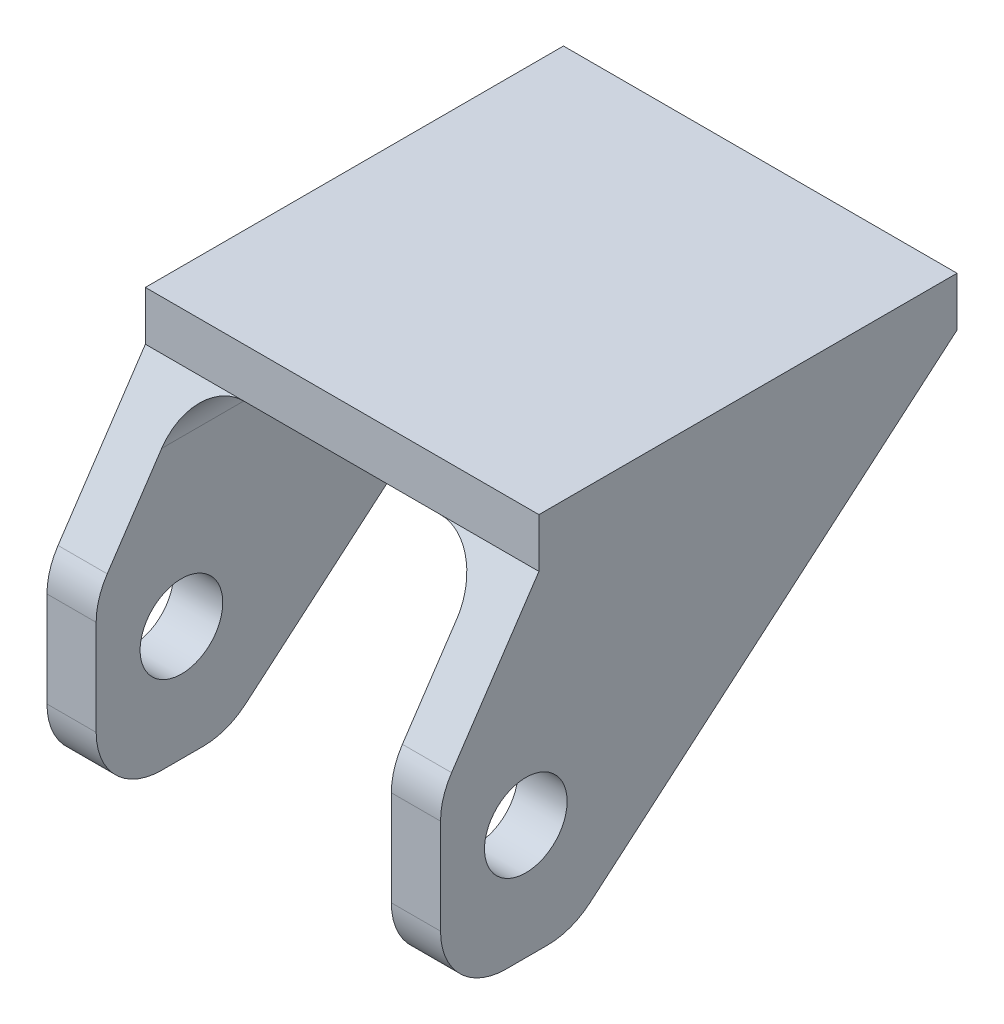
ISO-10303-21;
HEADER;
FILE_DESCRIPTION(('STEP AP214'),'2;1');
FILE_NAME('part.step','',(''),(''),'','','');
FILE_SCHEMA(('AUTOMOTIVE_DESIGN { 1 0 10303 214 1 1 1 1 }'));
ENDSEC;
DATA;
#1=APPLICATION_CONTEXT('core data for automotive mechanical design processes');
#2=APPLICATION_PROTOCOL_DEFINITION('international standard','automotive_design',2000,#1);
#3=PRODUCT_CONTEXT('',#1,'mechanical');
#4=PRODUCT('Part','Part','',(#3));
#5=PRODUCT_RELATED_PRODUCT_CATEGORY('part','',(#4));
#6=PRODUCT_DEFINITION_FORMATION('','',#4);
#7=PRODUCT_DEFINITION_CONTEXT('part definition',#1,'design');
#8=PRODUCT_DEFINITION('design','',#6,#7);
#9=PRODUCT_DEFINITION_SHAPE('','',#8);
#10=(LENGTH_UNIT() NAMED_UNIT(*) SI_UNIT(.MILLI.,.METRE.));
#11=(NAMED_UNIT(*) PLANE_ANGLE_UNIT() SI_UNIT($,.RADIAN.));
#12=(NAMED_UNIT(*) SI_UNIT($,.STERADIAN.) SOLID_ANGLE_UNIT());
#13=UNCERTAINTY_MEASURE_WITH_UNIT(LENGTH_MEASURE(1.E-05),#10,'distance_accuracy_value','');
#14=(GEOMETRIC_REPRESENTATION_CONTEXT(3) GLOBAL_UNCERTAINTY_ASSIGNED_CONTEXT((#13)) GLOBAL_UNIT_ASSIGNED_CONTEXT((#10,
#11,#12)) REPRESENTATION_CONTEXT('',''));
#15=CARTESIAN_POINT('',(0.,0.,0.));
#16=DIRECTION('',(0.,0.,1.));
#17=DIRECTION('',(1.,0.,0.));
#18=AXIS2_PLACEMENT_3D('',#15,#16,#17);
#19=CARTESIAN_POINT('',(0.,4.7625,25.));
#20=DIRECTION('',(0.,0.,1.));
#21=DIRECTION('',(1.,0.,0.));
#22=AXIS2_PLACEMENT_3D('',#19,#20,#21);
#23=PLANE('',#22);
#24=DIRECTION('',(0.,1.,0.));
#25=VECTOR('',#24,1.);
#26=CARTESIAN_POINT('',(-14.2875,-31.75,25.));
#27=LINE('',#26,#25);
#28=CARTESIAN_POINT('',(-14.2875,-25.4,25.));
#29=VERTEX_POINT('',#28);
#30=CARTESIAN_POINT('',(-14.2875,-16.1746990921694,25.));
#31=VERTEX_POINT('',#30);
#32=EDGE_CURVE('E384',#29,#31,#27,.T.);
#33=ORIENTED_EDGE('',*,*,#32,.T.);
#34=DIRECTION('',(1.,0.,0.));
#35=VECTOR('',#34,1.);
#36=CARTESIAN_POINT('',(-19.05,-16.1746990921694,25.));
#37=LINE('',#36,#35);
#38=CARTESIAN_POINT('',(-19.05,-16.1746990921694,25.));
#39=VERTEX_POINT('',#38);
#40=EDGE_CURVE('E292',#31,#39,#37,.F.);
#41=ORIENTED_EDGE('',*,*,#40,.T.);
#42=DIRECTION('',(0.,-1.,0.));
#43=VECTOR('',#42,1.);
#44=CARTESIAN_POINT('',(-19.05,4.7625,25.));
#45=LINE('',#44,#43);
#46=CARTESIAN_POINT('',(-19.05,-25.4,25.));
#47=VERTEX_POINT('',#46);
#48=EDGE_CURVE('E210',#39,#47,#45,.T.);
#49=ORIENTED_EDGE('',*,*,#48,.T.);
#50=DIRECTION('',(-1.,0.,0.));
#51=VECTOR('',#50,1.);
#52=CARTESIAN_POINT('',(-14.2875,-25.4,25.));
#53=LINE('',#52,#51);
#54=EDGE_CURVE('E289',#47,#29,#53,.F.);
#55=ORIENTED_EDGE('',*,*,#54,.T.);
#56=EDGE_LOOP('',(#33,#41,#49,#55));
#57=FACE_BOUND('',#56,.T.);
#58=ADVANCED_FACE('F41',(#57),#23,.T.);
#59=CARTESIAN_POINT('',(0.,0.,0.));
#60=DIRECTION('',(0.,1.,0.));
#61=DIRECTION('',(0.,0.,1.));
#62=AXIS2_PLACEMENT_3D('',#59,#60,#61);
#63=PLANE('',#62);
#64=DIRECTION('',(-1.,0.,0.));
#65=VECTOR('',#64,1.);
#66=CARTESIAN_POINT('',(0.,0.,-25.));
#67=LINE('',#66,#65);
#68=CARTESIAN_POINT('',(9.525,0.,-25.));
#69=VERTEX_POINT('',#68);
#70=CARTESIAN_POINT('',(-9.52500000000001,0.,-25.));
#71=VERTEX_POINT('',#70);
#72=EDGE_CURVE('E199',#69,#71,#67,.T.);
#73=ORIENTED_EDGE('',*,*,#72,.F.);
#74=DIRECTION('',(0.,0.,-1.));
#75=VECTOR('',#74,1.);
#76=CARTESIAN_POINT('',(9.525,0.,15.475));
#77=LINE('',#76,#75);
#78=CARTESIAN_POINT('',(9.525,0.,15.475));
#79=VERTEX_POINT('',#78);
#80=EDGE_CURVE('E314',#69,#79,#77,.F.);
#81=ORIENTED_EDGE('',*,*,#80,.T.);
#82=DIRECTION('',(1.,0.,0.));
#83=VECTOR('',#82,1.);
#84=CARTESIAN_POINT('',(-19.05,0.,15.475));
#85=LINE('',#84,#83);
#86=CARTESIAN_POINT('',(-9.52500000000001,0.,15.475));
#87=VERTEX_POINT('',#86);
#88=EDGE_CURVE('E758',#87,#79,#85,.T.);
#89=ORIENTED_EDGE('',*,*,#88,.F.);
#90=DIRECTION('',(0.,0.,-1.));
#91=VECTOR('',#90,1.);
#92=CARTESIAN_POINT('',(-9.52500000000001,0.,0.));
#93=LINE('',#92,#91);
#94=EDGE_CURVE('E310',#87,#71,#93,.T.);
#95=ORIENTED_EDGE('',*,*,#94,.T.);
#96=EDGE_LOOP('',(#73,#81,#89,#95));
#97=FACE_BOUND('',#96,.T.);
#98=ADVANCED_FACE('F464',(#97),#63,.F.);
#99=CARTESIAN_POINT('',(0.,4.7625,-25.));
#100=DIRECTION('',(0.,0.,1.));
#101=DIRECTION('',(1.,0.,0.));
#102=AXIS2_PLACEMENT_3D('',#99,#100,#101);
#103=PLANE('',#102);
#104=DIRECTION('',(0.,-1.,0.));
#105=VECTOR('',#104,1.);
#106=CARTESIAN_POINT('',(19.05,4.7625,-25.));
#107=LINE('',#106,#105);
#108=CARTESIAN_POINT('',(19.05,4.7625,-25.));
#109=VERTEX_POINT('',#108);
#110=CARTESIAN_POINT('',(19.05,0.,-25.));
#111=VERTEX_POINT('',#110);
#112=EDGE_CURVE('E397',#109,#111,#107,.T.);
#113=ORIENTED_EDGE('',*,*,#112,.T.);
#114=DIRECTION('',(1.,0.,0.));
#115=VECTOR('',#114,1.);
#116=CARTESIAN_POINT('',(-19.05,0.,-25.));
#117=LINE('',#116,#115);
#118=EDGE_CURVE('E66',#69,#111,#117,.T.);
#119=ORIENTED_EDGE('',*,*,#118,.F.);
#120=ORIENTED_EDGE('',*,*,#72,.T.);
#121=CARTESIAN_POINT('',(-19.05,0.,-25.));
#122=VERTEX_POINT('',#121);
#123=EDGE_CURVE('E82',#122,#71,#117,.T.);
#124=ORIENTED_EDGE('',*,*,#123,.F.);
#125=DIRECTION('',(0.,-1.,0.));
#126=VECTOR('',#125,1.);
#127=CARTESIAN_POINT('',(-19.05,4.7625,-25.));
#128=LINE('',#127,#126);
#129=CARTESIAN_POINT('',(-19.05,4.7625,-25.));
#130=VERTEX_POINT('',#129);
#131=EDGE_CURVE('E198',#130,#122,#128,.T.);
#132=ORIENTED_EDGE('',*,*,#131,.F.);
#133=DIRECTION('',(-1.,0.,0.));
#134=VECTOR('',#133,1.);
#135=CARTESIAN_POINT('',(0.,4.7625,-25.));
#136=LINE('',#135,#134);
#137=EDGE_CURVE('E388',#109,#130,#136,.T.);
#138=ORIENTED_EDGE('',*,*,#137,.F.);
#139=EDGE_LOOP('',(#113,#119,#120,#124,#132,#138));
#140=FACE_BOUND('',#139,.T.);
#141=ADVANCED_FACE('F196',(#140),#103,.F.);
#142=CARTESIAN_POINT('',(-19.05,4.7625,0.));
#143=DIRECTION('',(1.,0.,0.));
#144=DIRECTION('',(0.,0.,-1.));
#145=AXIS2_PLACEMENT_3D('',#142,#143,#144);
#146=PLANE('',#145);
#147=CARTESIAN_POINT('',(-19.05,-20.6375,16.745));
#148=DIRECTION('',(1.,0.,0.));
#149=DIRECTION('',(0.,0.,-1.));
#150=AXIS2_PLACEMENT_3D('',#147,#148,#149);
#151=CIRCLE('',#150,4.);
#152=CARTESIAN_POINT('',(-19.05,-20.6375,12.745));
#153=VERTEX_POINT('',#152);
#154=EDGE_CURVE('E355',#153,#153,#151,.T.);
#155=ORIENTED_EDGE('',*,*,#154,.T.);
#156=EDGE_LOOP('',(#155));
#157=FACE_BOUND('',#156,.T.);
#158=DIRECTION('',(0.,-0.648181604007245,0.761485789904575));
#159=VECTOR('',#158,1.);
#160=CARTESIAN_POINT('',(-19.05,-12.3395270182268,-10.5034847943351));
#161=LINE('',#160,#159);
#162=CARTESIAN_POINT('',(-19.05,-30.235434765894,10.5206839926881));
#163=VERTEX_POINT('',#162);
#164=EDGE_CURVE('E185',#122,#163,#161,.T.);
#165=ORIENTED_EDGE('',*,*,#164,.T.);
#166=CARTESIAN_POINT('',(-19.05,-25.4,14.6366371781341));
#167=DIRECTION('',(1.,0.,0.));
#168=DIRECTION('',(0.,0.,-1.));
#169=AXIS2_PLACEMENT_3D('',#166,#167,#168);
#170=CIRCLE('',#169,6.35);
#171=CARTESIAN_POINT('',(-19.05,-31.75,14.6366371781341));
#172=VERTEX_POINT('',#171);
#173=EDGE_CURVE('E253',#163,#172,#170,.F.);
#174=ORIENTED_EDGE('',*,*,#173,.T.);
#175=DIRECTION('',(0.,0.,1.));
#176=VECTOR('',#175,1.);
#177=CARTESIAN_POINT('',(-19.05,-31.75,0.));
#178=LINE('',#177,#176);
#179=CARTESIAN_POINT('',(-19.05,-31.75,18.65));
#180=VERTEX_POINT('',#179);
#181=EDGE_CURVE('E376',#172,#180,#178,.T.);
#182=ORIENTED_EDGE('',*,*,#181,.T.);
#183=CARTESIAN_POINT('',(-19.05,-25.4,18.65));
#184=DIRECTION('',(1.,0.,0.));
#185=DIRECTION('',(0.,0.,-1.));
#186=AXIS2_PLACEMENT_3D('',#183,#184,#185);
#187=CIRCLE('',#186,6.35);
#188=EDGE_CURVE('E247',#180,#47,#187,.F.);
#189=ORIENTED_EDGE('',*,*,#188,.T.);
#190=ORIENTED_EDGE('',*,*,#48,.F.);
#191=CARTESIAN_POINT('',(-19.05,-16.1746990921694,18.65));
#192=DIRECTION('',(1.,0.,0.));
#193=DIRECTION('',(0.,0.,-1.));
#194=AXIS2_PLACEMENT_3D('',#191,#192,#193);
#195=CIRCLE('',#194,6.35);
#196=CARTESIAN_POINT('',(-19.05,-12.6455319689373,23.9289657525218));
#197=VERTEX_POINT('',#196);
#198=EDGE_CURVE('E250',#39,#197,#195,.F.);
#199=ORIENTED_EDGE('',*,*,#198,.T.);
#200=DIRECTION('',(0.,0.831333189373505,-0.555774350115293));
#201=VECTOR('',#200,1.);
#202=CARTESIAN_POINT('',(-19.05,7.14997093575034,10.695002640392));
#203=LINE('',#202,#201);
#204=CARTESIAN_POINT('',(-19.05,0.,15.475));
#205=VERTEX_POINT('',#204);
#206=EDGE_CURVE('E424',#197,#205,#203,.T.);
#207=ORIENTED_EDGE('',*,*,#206,.T.);
#208=DIRECTION('',(0.,1.,0.));
#209=VECTOR('',#208,1.);
#210=CARTESIAN_POINT('',(-19.05,0.,15.475));
#211=LINE('',#210,#209);
#212=CARTESIAN_POINT('',(-19.05,4.7625,15.475));
#213=VERTEX_POINT('',#212);
#214=EDGE_CURVE('E428',#205,#213,#211,.T.);
#215=ORIENTED_EDGE('',*,*,#214,.T.);
#216=DIRECTION('',(0.,0.,1.));
#217=VECTOR('',#216,1.);
#218=CARTESIAN_POINT('',(-19.05,4.7625,0.));
#219=LINE('',#218,#217);
#220=EDGE_CURVE('E206',#130,#213,#219,.T.);
#221=ORIENTED_EDGE('',*,*,#220,.F.);
#222=ORIENTED_EDGE('',*,*,#131,.T.);
#223=EDGE_LOOP('',(#165,#174,#182,#189,#190,#199,#207,#215,#221,#222));
#224=FACE_BOUND('',#223,.T.);
#225=ADVANCED_FACE('F203',(#157,#224),#146,.F.);
#226=DIRECTION('',(0.,-1.,0.));
#227=VECTOR('',#226,1.);
#228=CARTESIAN_POINT('',(19.05,4.7625,25.));
#229=LINE('',#228,#227);
#230=CARTESIAN_POINT('',(19.05,-16.1746990921694,25.));
#231=VERTEX_POINT('',#230);
#232=CARTESIAN_POINT('',(19.05,-25.4,25.));
#233=VERTEX_POINT('',#232);
#234=EDGE_CURVE('E218',#231,#233,#229,.T.);
#235=ORIENTED_EDGE('',*,*,#234,.F.);
#236=DIRECTION('',(1.,0.,0.));
#237=VECTOR('',#236,1.);
#238=CARTESIAN_POINT('',(14.2875,-16.1746990921694,25.));
#239=LINE('',#238,#237);
#240=CARTESIAN_POINT('',(14.2875,-16.1746990921694,25.));
#241=VERTEX_POINT('',#240);
#242=EDGE_CURVE('E303',#231,#241,#239,.F.);
#243=ORIENTED_EDGE('',*,*,#242,.T.);
#244=DIRECTION('',(0.,1.,0.));
#245=VECTOR('',#244,1.);
#246=CARTESIAN_POINT('',(14.2875,-31.75,25.));
#247=LINE('',#246,#245);
#248=CARTESIAN_POINT('',(14.2875,-25.4,25.));
#249=VERTEX_POINT('',#248);
#250=EDGE_CURVE('E373',#249,#241,#247,.T.);
#251=ORIENTED_EDGE('',*,*,#250,.F.);
#252=DIRECTION('',(1.,0.,0.));
#253=VECTOR('',#252,1.);
#254=CARTESIAN_POINT('',(19.05,-25.4,25.));
#255=LINE('',#254,#253);
#256=EDGE_CURVE('E299',#249,#233,#255,.T.);
#257=ORIENTED_EDGE('',*,*,#256,.T.);
#258=EDGE_LOOP('',(#235,#243,#251,#257));
#259=FACE_BOUND('',#258,.T.);
#260=ADVANCED_FACE('F411',(#259),#23,.T.);
#261=CARTESIAN_POINT('',(19.05,4.7625,0.));
#262=DIRECTION('',(1.,0.,0.));
#263=DIRECTION('',(0.,0.,-1.));
#264=AXIS2_PLACEMENT_3D('',#261,#262,#263);
#265=PLANE('',#264);
#266=DIRECTION('',(0.,0.,1.));
#267=VECTOR('',#266,1.);
#268=CARTESIAN_POINT('',(19.05,-31.75,0.));
#269=LINE('',#268,#267);
#270=CARTESIAN_POINT('',(19.05,-31.75,14.6366371781341));
#271=VERTEX_POINT('',#270);
#272=CARTESIAN_POINT('',(19.05,-31.75,18.65));
#273=VERTEX_POINT('',#272);
#274=EDGE_CURVE('E365',#271,#273,#269,.T.);
#275=ORIENTED_EDGE('',*,*,#274,.F.);
#276=CARTESIAN_POINT('',(19.05,-25.4,14.6366371781341));
#277=DIRECTION('',(1.,0.,0.));
#278=DIRECTION('',(0.,0.,-1.));
#279=AXIS2_PLACEMENT_3D('',#276,#277,#278);
#280=CIRCLE('',#279,6.35);
#281=CARTESIAN_POINT('',(19.05,-30.2354347658941,10.5206839926881));
#282=VERTEX_POINT('',#281);
#283=EDGE_CURVE('E269',#271,#282,#280,.T.);
#284=ORIENTED_EDGE('',*,*,#283,.T.);
#285=DIRECTION('',(0.,-0.648181604007245,0.761485789904575));
#286=VECTOR('',#285,1.);
#287=CARTESIAN_POINT('',(19.05,-12.3395270182268,-10.5034847943351));
#288=LINE('',#287,#286);
#289=EDGE_CURVE('E193',#111,#282,#288,.T.);
#290=ORIENTED_EDGE('',*,*,#289,.F.);
#291=ORIENTED_EDGE('',*,*,#112,.F.);
#292=DIRECTION('',(0.,0.,1.));
#293=VECTOR('',#292,1.);
#294=CARTESIAN_POINT('',(19.05,4.7625,0.));
#295=LINE('',#294,#293);
#296=CARTESIAN_POINT('',(19.05,4.7625,15.475));
#297=VERTEX_POINT('',#296);
#298=EDGE_CURVE('E393',#109,#297,#295,.T.);
#299=ORIENTED_EDGE('',*,*,#298,.T.);
#300=DIRECTION('',(0.,1.,0.));
#301=VECTOR('',#300,1.);
#302=CARTESIAN_POINT('',(19.05,0.,15.475));
#303=LINE('',#302,#301);
#304=CARTESIAN_POINT('',(19.05,0.,15.475));
#305=VERTEX_POINT('',#304);
#306=EDGE_CURVE('E418',#305,#297,#303,.T.);
#307=ORIENTED_EDGE('',*,*,#306,.F.);
#308=DIRECTION('',(0.,0.831333189373505,-0.555774350115293));
#309=VECTOR('',#308,1.);
#310=CARTESIAN_POINT('',(19.05,7.14997093575034,10.695002640392));
#311=LINE('',#310,#309);
#312=CARTESIAN_POINT('',(19.05,-12.6455319689373,23.9289657525218));
#313=VERTEX_POINT('',#312);
#314=EDGE_CURVE('E416',#313,#305,#311,.T.);
#315=ORIENTED_EDGE('',*,*,#314,.F.);
#316=CARTESIAN_POINT('',(19.05,-16.1746990921694,18.65));
#317=DIRECTION('',(1.,0.,0.));
#318=DIRECTION('',(0.,0.,-1.));
#319=AXIS2_PLACEMENT_3D('',#316,#317,#318);
#320=CIRCLE('',#319,6.35);
#321=EDGE_CURVE('E266',#313,#231,#320,.T.);
#322=ORIENTED_EDGE('',*,*,#321,.T.);
#323=ORIENTED_EDGE('',*,*,#234,.T.);
#324=CARTESIAN_POINT('',(19.05,-25.4,18.65));
#325=DIRECTION('',(1.,0.,0.));
#326=DIRECTION('',(0.,0.,-1.));
#327=AXIS2_PLACEMENT_3D('',#324,#325,#326);
#328=CIRCLE('',#327,6.35);
#329=EDGE_CURVE('E263',#233,#273,#328,.T.);
#330=ORIENTED_EDGE('',*,*,#329,.T.);
#331=EDGE_LOOP('',(#275,#284,#290,#291,#299,#307,#315,#322,#323,#330));
#332=FACE_BOUND('',#331,.T.);
#333=CARTESIAN_POINT('',(19.05,-20.6375,16.745));
#334=DIRECTION('',(1.,0.,0.));
#335=DIRECTION('',(0.,0.,-1.));
#336=AXIS2_PLACEMENT_3D('',#333,#334,#335);
#337=CIRCLE('',#336,4.);
#338=CARTESIAN_POINT('',(19.05,-20.6375,12.745));
#339=VERTEX_POINT('',#338);
#340=EDGE_CURVE('E432',#339,#339,#337,.T.);
#341=ORIENTED_EDGE('',*,*,#340,.F.);
#342=EDGE_LOOP('',(#341));
#343=FACE_BOUND('',#342,.T.);
#344=ADVANCED_FACE('F406',(#332,#343),#265,.T.);
#345=CARTESIAN_POINT('',(0.,4.7625,0.));
#346=DIRECTION('',(0.,1.,0.));
#347=DIRECTION('',(0.,0.,1.));
#348=AXIS2_PLACEMENT_3D('',#345,#346,#347);
#349=PLANE('',#348);
#350=DIRECTION('',(1.,0.,0.));
#351=VECTOR('',#350,1.);
#352=CARTESIAN_POINT('',(-19.05,4.7625,15.475));
#353=LINE('',#352,#351);
#354=EDGE_CURVE('E435',#213,#297,#353,.T.);
#355=ORIENTED_EDGE('',*,*,#354,.T.);
#356=ORIENTED_EDGE('',*,*,#298,.F.);
#357=ORIENTED_EDGE('',*,*,#137,.T.);
#358=ORIENTED_EDGE('',*,*,#220,.T.);
#359=EDGE_LOOP('',(#355,#356,#357,#358));
#360=FACE_BOUND('',#359,.T.);
#361=ADVANCED_FACE('F479',(#360),#349,.T.);
#362=CARTESIAN_POINT('',(-14.2875,-31.75,0.));
#363=DIRECTION('',(1.,0.,0.));
#364=DIRECTION('',(0.,0.,-1.));
#365=AXIS2_PLACEMENT_3D('',#362,#363,#364);
#366=PLANE('',#365);
#367=DIRECTION('',(0.,-0.648181604007245,0.761485789904575));
#368=VECTOR('',#367,1.);
#369=CARTESIAN_POINT('',(-14.2875,-25.6789527070324,5.16771451881289));
#370=LINE('',#369,#368);
#371=CARTESIAN_POINT('',(-14.2875,-4.7625,-19.405));
#372=VERTEX_POINT('',#371);
#373=CARTESIAN_POINT('',(-14.2875,-30.2354347658941,10.5206839926881));
#374=VERTEX_POINT('',#373);
#375=EDGE_CURVE('E226',#372,#374,#370,.T.);
#376=ORIENTED_EDGE('',*,*,#375,.F.);
#377=DIRECTION('',(0.,0.,-1.));
#378=VECTOR('',#377,1.);
#379=CARTESIAN_POINT('',(-14.2875,-4.7625,0.));
#380=LINE('',#379,#378);
#381=CARTESIAN_POINT('',(-14.2875,-4.7625,18.6588923024579));
#382=VERTEX_POINT('',#381);
#383=EDGE_CURVE('E318',#372,#382,#380,.F.);
#384=ORIENTED_EDGE('',*,*,#383,.T.);
#385=DIRECTION('',(0.,0.831333189373505,-0.555774350115293));
#386=VECTOR('',#385,1.);
#387=CARTESIAN_POINT('',(-14.2875,-14.7929262424368,25.3645714423353));
#388=LINE('',#387,#386);
#389=CARTESIAN_POINT('',(-14.2875,-12.6455319689373,23.9289657525218));
#390=VERTEX_POINT('',#389);
#391=EDGE_CURVE('E361',#390,#382,#388,.T.);
#392=ORIENTED_EDGE('',*,*,#391,.F.);
#393=CARTESIAN_POINT('',(-14.2875,-16.1746990921694,18.65));
#394=DIRECTION('',(1.,0.,0.));
#395=DIRECTION('',(0.,0.,-1.));
#396=AXIS2_PLACEMENT_3D('',#393,#394,#395);
#397=CIRCLE('',#396,6.35);
#398=EDGE_CURVE('E238',#390,#31,#397,.T.);
#399=ORIENTED_EDGE('',*,*,#398,.T.);
#400=ORIENTED_EDGE('',*,*,#32,.F.);
#401=CARTESIAN_POINT('',(-14.2875,-25.4,18.65));
#402=DIRECTION('',(1.,0.,0.));
#403=DIRECTION('',(0.,0.,-1.));
#404=AXIS2_PLACEMENT_3D('',#401,#402,#403);
#405=CIRCLE('',#404,6.35);
#406=CARTESIAN_POINT('',(-14.2875,-31.75,18.65));
#407=VERTEX_POINT('',#406);
#408=EDGE_CURVE('E235',#29,#407,#405,.T.);
#409=ORIENTED_EDGE('',*,*,#408,.T.);
#410=DIRECTION('',(0.,0.,-1.));
#411=VECTOR('',#410,1.);
#412=CARTESIAN_POINT('',(-14.2875,-31.75,0.));
#413=LINE('',#412,#411);
#414=CARTESIAN_POINT('',(-14.2875,-31.75,14.6366371781341));
#415=VERTEX_POINT('',#414);
#416=EDGE_CURVE('E380',#407,#415,#413,.T.);
#417=ORIENTED_EDGE('',*,*,#416,.T.);
#418=CARTESIAN_POINT('',(-14.2875,-25.4,14.6366371781341));
#419=DIRECTION('',(1.,0.,0.));
#420=DIRECTION('',(0.,0.,-1.));
#421=AXIS2_PLACEMENT_3D('',#418,#419,#420);
#422=CIRCLE('',#421,6.35);
#423=EDGE_CURVE('E241',#415,#374,#422,.T.);
#424=ORIENTED_EDGE('',*,*,#423,.T.);
#425=EDGE_LOOP('',(#376,#384,#392,#399,#400,#409,#417,#424));
#426=FACE_BOUND('',#425,.T.);
#427=CARTESIAN_POINT('',(-14.2875,-20.6375,16.745));
#428=DIRECTION('',(1.,0.,0.));
#429=DIRECTION('',(0.,0.,-1.));
#430=AXIS2_PLACEMENT_3D('',#427,#428,#429);
#431=CIRCLE('',#430,4.);
#432=CARTESIAN_POINT('',(-14.2875,-20.6375,12.745));
#433=VERTEX_POINT('',#432);
#434=EDGE_CURVE('E225',#433,#433,#431,.T.);
#435=ORIENTED_EDGE('',*,*,#434,.F.);
#436=EDGE_LOOP('',(#435));
#437=FACE_BOUND('',#436,.T.);
#438=ADVANCED_FACE('F517',(#426,#437),#366,.T.);
#439=CARTESIAN_POINT('',(0.,-31.75,0.));
#440=DIRECTION('',(0.,1.,0.));
#441=DIRECTION('',(0.,0.,1.));
#442=AXIS2_PLACEMENT_3D('',#439,#440,#441);
#443=PLANE('',#442);
#444=ORIENTED_EDGE('',*,*,#181,.F.);
#445=DIRECTION('',(1.,0.,0.));
#446=VECTOR('',#445,1.);
#447=CARTESIAN_POINT('',(0.,-31.75,14.6366371781341));
#448=LINE('',#447,#446);
#449=EDGE_CURVE('E231',#172,#415,#448,.T.);
#450=ORIENTED_EDGE('',*,*,#449,.T.);
#451=ORIENTED_EDGE('',*,*,#416,.F.);
#452=DIRECTION('',(-1.,0.,0.));
#453=VECTOR('',#452,1.);
#454=CARTESIAN_POINT('',(-19.05,-31.75,18.65));
#455=LINE('',#454,#453);
#456=EDGE_CURVE('E215',#407,#180,#455,.T.);
#457=ORIENTED_EDGE('',*,*,#456,.T.);
#458=EDGE_LOOP('',(#444,#450,#451,#457));
#459=FACE_BOUND('',#458,.T.);
#460=ADVANCED_FACE('F524',(#459),#443,.F.);
#461=CARTESIAN_POINT('',(14.2875,-31.75,0.));
#462=DIRECTION('',(1.,0.,0.));
#463=DIRECTION('',(0.,0.,-1.));
#464=AXIS2_PLACEMENT_3D('',#461,#462,#463);
#465=PLANE('',#464);
#466=CARTESIAN_POINT('',(14.2875,-20.6375,16.745));
#467=DIRECTION('',(1.,0.,0.));
#468=DIRECTION('',(0.,0.,-1.));
#469=AXIS2_PLACEMENT_3D('',#466,#467,#468);
#470=CIRCLE('',#469,4.);
#471=CARTESIAN_POINT('',(14.2875,-20.6375,12.745));
#472=VERTEX_POINT('',#471);
#473=EDGE_CURVE('E222',#472,#472,#470,.T.);
#474=ORIENTED_EDGE('',*,*,#473,.T.);
#475=EDGE_LOOP('',(#474));
#476=FACE_BOUND('',#475,.T.);
#477=DIRECTION('',(0.,0.831333189373505,-0.555774350115293));
#478=VECTOR('',#477,1.);
#479=CARTESIAN_POINT('',(14.2875,-14.7929262424368,25.3645714423353));
#480=LINE('',#479,#478);
#481=CARTESIAN_POINT('',(14.2875,-12.6455319689373,23.9289657525218));
#482=VERTEX_POINT('',#481);
#483=CARTESIAN_POINT('',(14.2875,-4.7625,18.6588923024579));
#484=VERTEX_POINT('',#483);
#485=EDGE_CURVE('E209',#482,#484,#480,.T.);
#486=ORIENTED_EDGE('',*,*,#485,.T.);
#487=DIRECTION('',(0.,0.,-1.));
#488=VECTOR('',#487,1.);
#489=CARTESIAN_POINT('',(14.2875,-4.7625,-25.));
#490=LINE('',#489,#488);
#491=CARTESIAN_POINT('',(14.2875,-4.7625,-19.405));
#492=VERTEX_POINT('',#491);
#493=EDGE_CURVE('E306',#484,#492,#490,.T.);
#494=ORIENTED_EDGE('',*,*,#493,.T.);
#495=DIRECTION('',(0.,-0.648181604007245,0.761485789904575));
#496=VECTOR('',#495,1.);
#497=CARTESIAN_POINT('',(14.2875,-25.6789527070324,5.16771451881289));
#498=LINE('',#497,#496);
#499=CARTESIAN_POINT('',(14.2875,-30.2354347658941,10.5206839926881));
#500=VERTEX_POINT('',#499);
#501=EDGE_CURVE('E201',#492,#500,#498,.T.);
#502=ORIENTED_EDGE('',*,*,#501,.T.);
#503=CARTESIAN_POINT('',(14.2875,-25.4,14.6366371781341));
#504=DIRECTION('',(1.,0.,0.));
#505=DIRECTION('',(0.,0.,-1.));
#506=AXIS2_PLACEMENT_3D('',#503,#504,#505);
#507=CIRCLE('',#506,6.35);
#508=CARTESIAN_POINT('',(14.2875,-31.75,14.6366371781341));
#509=VERTEX_POINT('',#508);
#510=EDGE_CURVE('E282',#500,#509,#507,.F.);
#511=ORIENTED_EDGE('',*,*,#510,.T.);
#512=DIRECTION('',(0.,0.,-1.));
#513=VECTOR('',#512,1.);
#514=CARTESIAN_POINT('',(14.2875,-31.75,0.));
#515=LINE('',#514,#513);
#516=CARTESIAN_POINT('',(14.2875,-31.75,18.65));
#517=VERTEX_POINT('',#516);
#518=EDGE_CURVE('E369',#517,#509,#515,.T.);
#519=ORIENTED_EDGE('',*,*,#518,.F.);
#520=CARTESIAN_POINT('',(14.2875,-25.4,18.65));
#521=DIRECTION('',(1.,0.,0.));
#522=DIRECTION('',(0.,0.,-1.));
#523=AXIS2_PLACEMENT_3D('',#520,#521,#522);
#524=CIRCLE('',#523,6.35);
#525=EDGE_CURVE('E276',#517,#249,#524,.F.);
#526=ORIENTED_EDGE('',*,*,#525,.T.);
#527=ORIENTED_EDGE('',*,*,#250,.T.);
#528=CARTESIAN_POINT('',(14.2875,-16.1746990921694,18.65));
#529=DIRECTION('',(1.,0.,0.));
#530=DIRECTION('',(0.,0.,-1.));
#531=AXIS2_PLACEMENT_3D('',#528,#529,#530);
#532=CIRCLE('',#531,6.35);
#533=EDGE_CURVE('E279',#241,#482,#532,.F.);
#534=ORIENTED_EDGE('',*,*,#533,.T.);
#535=EDGE_LOOP('',(#486,#494,#502,#511,#519,#526,#527,#534));
#536=FACE_BOUND('',#535,.T.);
#537=ADVANCED_FACE('F339',(#476,#536),#465,.F.);
#538=CARTESIAN_POINT('',(0.,-31.75,0.));
#539=DIRECTION('',(0.,1.,0.));
#540=DIRECTION('',(0.,0.,1.));
#541=AXIS2_PLACEMENT_3D('',#538,#539,#540);
#542=PLANE('',#541);
#543=ORIENTED_EDGE('',*,*,#518,.T.);
#544=DIRECTION('',(1.,0.,0.));
#545=VECTOR('',#544,1.);
#546=CARTESIAN_POINT('',(0.,-31.75,14.6366371781341));
#547=LINE('',#546,#545);
#548=EDGE_CURVE('E259',#509,#271,#547,.T.);
#549=ORIENTED_EDGE('',*,*,#548,.T.);
#550=ORIENTED_EDGE('',*,*,#274,.T.);
#551=DIRECTION('',(1.,0.,0.));
#552=VECTOR('',#551,1.);
#553=CARTESIAN_POINT('',(14.2875,-31.75,18.65));
#554=LINE('',#553,#552);
#555=EDGE_CURVE('E256',#273,#517,#554,.F.);
#556=ORIENTED_EDGE('',*,*,#555,.T.);
#557=EDGE_LOOP('',(#543,#549,#550,#556));
#558=FACE_BOUND('',#557,.T.);
#559=ADVANCED_FACE('F537',(#558),#542,.F.);
#560=CARTESIAN_POINT('',(-19.05,-12.3395270182268,-10.5034847943351));
#561=DIRECTION('',(0.,0.761485789904575,0.648181604007245));
#562=DIRECTION('',(0.,-0.648181604007245,0.761485789904575));
#563=AXIS2_PLACEMENT_3D('',#560,#561,#562);
#564=PLANE('',#563);
#565=ORIENTED_EDGE('',*,*,#289,.T.);
#566=DIRECTION('',(1.,0.,0.));
#567=VECTOR('',#566,1.);
#568=CARTESIAN_POINT('',(-19.05,-30.2354347658941,10.5206839926881));
#569=LINE('',#568,#567);
#570=EDGE_CURVE('E272',#282,#500,#569,.F.);
#571=ORIENTED_EDGE('',*,*,#570,.T.);
#572=ORIENTED_EDGE('',*,*,#501,.F.);
#573=CARTESIAN_POINT('',(9.525,-4.7625,-19.405));
#574=DIRECTION('',(0.,0.761485789904575,0.648181604007245));
#575=DIRECTION('',(0.,-0.648181604007245,0.761485789904575));
#576=AXIS2_PLACEMENT_3D('',#573,#574,#575);
#577=ELLIPSE('',#576,7.3474778836006,4.7625);
#578=EDGE_CURVE('E321',#492,#69,#577,.T.);
#579=ORIENTED_EDGE('',*,*,#578,.T.);
#580=ORIENTED_EDGE('',*,*,#118,.T.);
#581=EDGE_LOOP('',(#565,#571,#572,#579,#580));
#582=FACE_BOUND('',#581,.T.);
#583=ADVANCED_FACE('F346',(#582),#564,.F.);
#584=CARTESIAN_POINT('',(-19.05,-20.6375,16.745));
#585=DIRECTION('',(1.,0.,0.));
#586=DIRECTION('',(0.,0.,-1.));
#587=AXIS2_PLACEMENT_3D('',#584,#585,#586);
#588=CYLINDRICAL_SURFACE('',#587,4.);
#589=ORIENTED_EDGE('',*,*,#340,.T.);
#590=EDGE_LOOP('',(#589));
#591=FACE_BOUND('',#590,.T.);
#592=ORIENTED_EDGE('',*,*,#473,.F.);
#593=EDGE_LOOP('',(#592));
#594=FACE_BOUND('',#593,.T.);
#595=ADVANCED_FACE('F450',(#591,#594),#588,.F.);
#596=CARTESIAN_POINT('',(-19.05,7.14997093575034,10.695002640392));
#597=DIRECTION('',(0.,-0.555774350115293,-0.831333189373505));
#598=DIRECTION('',(0.,0.831333189373505,-0.555774350115293));
#599=AXIS2_PLACEMENT_3D('',#596,#597,#598);
#600=PLANE('',#599);
#601=ORIENTED_EDGE('',*,*,#485,.F.);
#602=DIRECTION('',(1.,0.,0.));
#603=VECTOR('',#602,1.);
#604=CARTESIAN_POINT('',(19.05,-12.6455319689373,23.9289657525218));
#605=LINE('',#604,#603);
#606=EDGE_CURVE('E295',#482,#313,#605,.T.);
#607=ORIENTED_EDGE('',*,*,#606,.T.);
#608=ORIENTED_EDGE('',*,*,#314,.T.);
#609=EDGE_CURVE('E334',#79,#305,#85,.T.);
#610=ORIENTED_EDGE('',*,*,#609,.F.);
#611=CARTESIAN_POINT('',(9.525,-4.7625,18.6588923024579));
#612=DIRECTION('',(0.,-0.555774350115293,-0.831333189373505));
#613=DIRECTION('',(0.,-0.831333189373505,0.555774350115293));
#614=AXIS2_PLACEMENT_3D('',#611,#612,#613);
#615=ELLIPSE('',#614,5.72874998962694,4.7625);
#616=EDGE_CURVE('E325',#79,#484,#615,.T.);
#617=ORIENTED_EDGE('',*,*,#616,.T.);
#618=EDGE_LOOP('',(#601,#607,#608,#610,#617));
#619=FACE_BOUND('',#618,.T.);
#620=ADVANCED_FACE('F331',(#619),#600,.F.);
#621=ORIENTED_EDGE('',*,*,#206,.F.);
#622=DIRECTION('',(1.,0.,0.));
#623=VECTOR('',#622,1.);
#624=CARTESIAN_POINT('',(-14.2875,-12.6455319689373,23.9289657525218));
#625=LINE('',#624,#623);
#626=EDGE_CURVE('E285',#197,#390,#625,.T.);
#627=ORIENTED_EDGE('',*,*,#626,.T.);
#628=ORIENTED_EDGE('',*,*,#391,.T.);
#629=CARTESIAN_POINT('',(-9.52500000000001,-4.7625,18.6588923024579));
#630=DIRECTION('',(0.,-0.555774350115293,-0.831333189373505));
#631=DIRECTION('',(0.,0.831333189373505,-0.555774350115293));
#632=AXIS2_PLACEMENT_3D('',#629,#630,#631);
#633=ELLIPSE('',#632,5.72874998962694,4.7625);
#634=EDGE_CURVE('E11',#382,#87,#633,.T.);
#635=ORIENTED_EDGE('',*,*,#634,.T.);
#636=EDGE_CURVE('E57',#205,#87,#85,.T.);
#637=ORIENTED_EDGE('',*,*,#636,.F.);
#638=EDGE_LOOP('',(#621,#627,#628,#635,#637));
#639=FACE_BOUND('',#638,.T.);
#640=ADVANCED_FACE('F513',(#639),#600,.F.);
#641=CARTESIAN_POINT('',(-19.05,0.,15.475));
#642=DIRECTION('',(0.,0.,-1.));
#643=DIRECTION('',(-1.,0.,0.));
#644=AXIS2_PLACEMENT_3D('',#641,#642,#643);
#645=PLANE('',#644);
#646=ORIENTED_EDGE('',*,*,#306,.T.);
#647=ORIENTED_EDGE('',*,*,#354,.F.);
#648=ORIENTED_EDGE('',*,*,#214,.F.);
#649=ORIENTED_EDGE('',*,*,#636,.T.);
#650=ORIENTED_EDGE('',*,*,#88,.T.);
#651=ORIENTED_EDGE('',*,*,#609,.T.);
#652=EDGE_LOOP('',(#646,#647,#648,#649,#650,#651));
#653=FACE_BOUND('',#652,.T.);
#654=ADVANCED_FACE('F458',(#653),#645,.F.);
#655=ORIENTED_EDGE('',*,*,#123,.T.);
#656=CARTESIAN_POINT('',(-9.52500000000001,-4.7625,-19.405));
#657=DIRECTION('',(0.,0.761485789904575,0.648181604007245));
#658=DIRECTION('',(0.,0.648181604007245,-0.761485789904575));
#659=AXIS2_PLACEMENT_3D('',#656,#657,#658);
#660=ELLIPSE('',#659,7.3474778836006,4.7625);
#661=EDGE_CURVE('E50',#71,#372,#660,.T.);
#662=ORIENTED_EDGE('',*,*,#661,.T.);
#663=ORIENTED_EDGE('',*,*,#375,.T.);
#664=DIRECTION('',(1.,0.,0.));
#665=VECTOR('',#664,1.);
#666=CARTESIAN_POINT('',(-19.05,-30.235434765894,10.5206839926881));
#667=LINE('',#666,#665);
#668=EDGE_CURVE('E188',#374,#163,#667,.F.);
#669=ORIENTED_EDGE('',*,*,#668,.T.);
#670=ORIENTED_EDGE('',*,*,#164,.F.);
#671=EDGE_LOOP('',(#655,#662,#663,#669,#670));
#672=FACE_BOUND('',#671,.T.);
#673=ADVANCED_FACE('F186',(#672),#564,.F.);
#674=ORIENTED_EDGE('',*,*,#434,.T.);
#675=EDGE_LOOP('',(#674));
#676=FACE_BOUND('',#675,.T.);
#677=ORIENTED_EDGE('',*,*,#154,.F.);
#678=EDGE_LOOP('',(#677));
#679=FACE_BOUND('',#678,.T.);
#680=ADVANCED_FACE('F445',(#676,#679),#588,.F.);
#681=CARTESIAN_POINT('',(0.,-25.4,14.6366371781341));
#682=DIRECTION('',(1.,0.,0.));
#683=DIRECTION('',(0.,0.,-1.));
#684=AXIS2_PLACEMENT_3D('',#681,#682,#683);
#685=CYLINDRICAL_SURFACE('',#684,6.35);
#686=ORIENTED_EDGE('',*,*,#173,.F.);
#687=ORIENTED_EDGE('',*,*,#668,.F.);
#688=ORIENTED_EDGE('',*,*,#423,.F.);
#689=ORIENTED_EDGE('',*,*,#449,.F.);
#690=EDGE_LOOP('',(#686,#687,#688,#689));
#691=FACE_BOUND('',#690,.T.);
#692=ADVANCED_FACE('F447',(#691),#685,.T.);
#693=CARTESIAN_POINT('',(0.,-25.4,14.6366371781341));
#694=DIRECTION('',(1.,0.,0.));
#695=DIRECTION('',(0.,0.,-1.));
#696=AXIS2_PLACEMENT_3D('',#693,#694,#695);
#697=CYLINDRICAL_SURFACE('',#696,6.35);
#698=ORIENTED_EDGE('',*,*,#510,.F.);
#699=ORIENTED_EDGE('',*,*,#570,.F.);
#700=ORIENTED_EDGE('',*,*,#283,.F.);
#701=ORIENTED_EDGE('',*,*,#548,.F.);
#702=EDGE_LOOP('',(#698,#699,#700,#701));
#703=FACE_BOUND('',#702,.T.);
#704=ADVANCED_FACE('F455',(#703),#697,.T.);
#705=CARTESIAN_POINT('',(-19.05,-16.1746990921694,18.65));
#706=DIRECTION('',(-1.,0.,0.));
#707=DIRECTION('',(0.,-1.,0.));
#708=AXIS2_PLACEMENT_3D('',#705,#706,#707);
#709=CYLINDRICAL_SURFACE('',#708,6.35);
#710=ORIENTED_EDGE('',*,*,#198,.F.);
#711=ORIENTED_EDGE('',*,*,#40,.F.);
#712=ORIENTED_EDGE('',*,*,#398,.F.);
#713=ORIENTED_EDGE('',*,*,#626,.F.);
#714=EDGE_LOOP('',(#710,#711,#712,#713));
#715=FACE_BOUND('',#714,.T.);
#716=ADVANCED_FACE('F487',(#715),#709,.T.);
#717=CARTESIAN_POINT('',(-19.05,-16.1746990921694,18.65));
#718=DIRECTION('',(-1.,0.,0.));
#719=DIRECTION('',(0.,-1.,0.));
#720=AXIS2_PLACEMENT_3D('',#717,#718,#719);
#721=CYLINDRICAL_SURFACE('',#720,6.35);
#722=ORIENTED_EDGE('',*,*,#533,.F.);
#723=ORIENTED_EDGE('',*,*,#242,.F.);
#724=ORIENTED_EDGE('',*,*,#321,.F.);
#725=ORIENTED_EDGE('',*,*,#606,.F.);
#726=EDGE_LOOP('',(#722,#723,#724,#725));
#727=FACE_BOUND('',#726,.T.);
#728=ADVANCED_FACE('F415',(#727),#721,.T.);
#729=CARTESIAN_POINT('',(0.,-25.4,18.65));
#730=DIRECTION('',(1.,0.,0.));
#731=DIRECTION('',(0.,0.,-1.));
#732=AXIS2_PLACEMENT_3D('',#729,#730,#731);
#733=CYLINDRICAL_SURFACE('',#732,6.35);
#734=ORIENTED_EDGE('',*,*,#408,.F.);
#735=ORIENTED_EDGE('',*,*,#54,.F.);
#736=ORIENTED_EDGE('',*,*,#188,.F.);
#737=ORIENTED_EDGE('',*,*,#456,.F.);
#738=EDGE_LOOP('',(#734,#735,#736,#737));
#739=FACE_BOUND('',#738,.T.);
#740=ADVANCED_FACE('F494',(#739),#733,.T.);
#741=CARTESIAN_POINT('',(0.,-25.4,18.65));
#742=DIRECTION('',(-1.,0.,0.));
#743=DIRECTION('',(0.,0.,1.));
#744=AXIS2_PLACEMENT_3D('',#741,#742,#743);
#745=CYLINDRICAL_SURFACE('',#744,6.35);
#746=ORIENTED_EDGE('',*,*,#525,.F.);
#747=ORIENTED_EDGE('',*,*,#555,.F.);
#748=ORIENTED_EDGE('',*,*,#329,.F.);
#749=ORIENTED_EDGE('',*,*,#256,.F.);
#750=EDGE_LOOP('',(#746,#747,#748,#749));
#751=FACE_BOUND('',#750,.T.);
#752=ADVANCED_FACE('F497',(#751),#745,.T.);
#753=CARTESIAN_POINT('',(9.525,-4.7625,0.));
#754=DIRECTION('',(0.,0.,1.));
#755=DIRECTION('',(1.,0.,0.));
#756=AXIS2_PLACEMENT_3D('',#753,#754,#755);
#757=CYLINDRICAL_SURFACE('',#756,4.7625);
#758=ORIENTED_EDGE('',*,*,#616,.F.);
#759=ORIENTED_EDGE('',*,*,#80,.F.);
#760=ORIENTED_EDGE('',*,*,#578,.F.);
#761=ORIENTED_EDGE('',*,*,#493,.F.);
#762=EDGE_LOOP('',(#758,#759,#760,#761));
#763=FACE_BOUND('',#762,.T.);
#764=ADVANCED_FACE('F343',(#763),#757,.F.);
#765=CARTESIAN_POINT('',(-9.52500000000001,-4.7625,0.));
#766=DIRECTION('',(0.,0.,-1.));
#767=DIRECTION('',(-1.,0.,0.));
#768=AXIS2_PLACEMENT_3D('',#765,#766,#767);
#769=CYLINDRICAL_SURFACE('',#768,4.7625);
#770=ORIENTED_EDGE('',*,*,#634,.F.);
#771=ORIENTED_EDGE('',*,*,#383,.F.);
#772=ORIENTED_EDGE('',*,*,#661,.F.);
#773=ORIENTED_EDGE('',*,*,#94,.F.);
#774=EDGE_LOOP('',(#770,#771,#772,#773));
#775=FACE_BOUND('',#774,.T.);
#776=ADVANCED_FACE('F43',(#775),#769,.F.);
#777=CLOSED_SHELL('',(#58,#98,#141,#225,#260,#344,#361,#438,#460,#537,#559,#583,#595,#620,#640,
#654,#673,#680,#692,#704,#716,#728,#740,#752,#764,#776));
#778=MANIFOLD_SOLID_BREP('B2',#777);
#779=ADVANCED_BREP_SHAPE_REPRESENTATION('',(#18,#778),#14);
#780=SHAPE_DEFINITION_REPRESENTATION(#9,#779);
ENDSEC;
END-ISO-10303-21;
